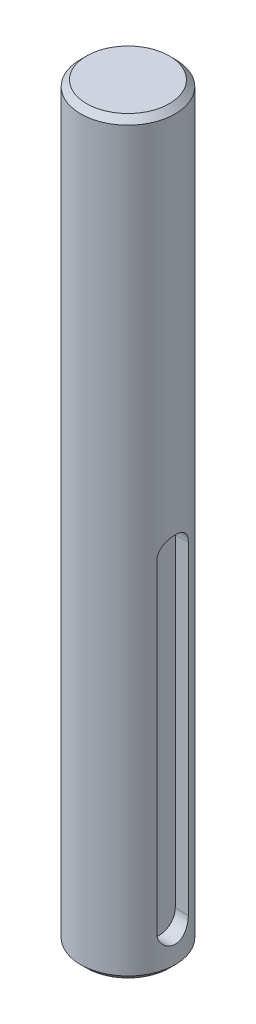
ISO-10303-21;
HEADER;
FILE_DESCRIPTION(('STEP AP214'),'2;1');
FILE_NAME('part.step','',(''),(''),'','','');
FILE_SCHEMA(('AUTOMOTIVE_DESIGN { 1 0 10303 214 1 1 1 1 }'));
ENDSEC;
DATA;
#1=APPLICATION_CONTEXT('core data for automotive mechanical design processes');
#2=APPLICATION_PROTOCOL_DEFINITION('international standard','automotive_design',2000,#1);
#3=PRODUCT_CONTEXT('',#1,'mechanical');
#4=PRODUCT('Part','Part','',(#3));
#5=PRODUCT_RELATED_PRODUCT_CATEGORY('part','',(#4));
#6=PRODUCT_DEFINITION_FORMATION('','',#4);
#7=PRODUCT_DEFINITION_CONTEXT('part definition',#1,'design');
#8=PRODUCT_DEFINITION('design','',#6,#7);
#9=PRODUCT_DEFINITION_SHAPE('','',#8);
#10=(LENGTH_UNIT() NAMED_UNIT(*) SI_UNIT(.MILLI.,.METRE.));
#11=(NAMED_UNIT(*) PLANE_ANGLE_UNIT() SI_UNIT($,.RADIAN.));
#12=(NAMED_UNIT(*) SI_UNIT($,.STERADIAN.) SOLID_ANGLE_UNIT());
#13=UNCERTAINTY_MEASURE_WITH_UNIT(LENGTH_MEASURE(1.E-05),#10,'distance_accuracy_value','');
#14=(GEOMETRIC_REPRESENTATION_CONTEXT(3) GLOBAL_UNCERTAINTY_ASSIGNED_CONTEXT((#13)) GLOBAL_UNIT_ASSIGNED_CONTEXT((#10,
#11,#12)) REPRESENTATION_CONTEXT('',''));
#15=CARTESIAN_POINT('',(0.,0.,0.));
#16=DIRECTION('',(0.,0.,1.));
#17=DIRECTION('',(1.,0.,0.));
#18=AXIS2_PLACEMENT_3D('',#15,#16,#17);
#19=CARTESIAN_POINT('',(0.,190.,0.));
#20=DIRECTION('',(0.,-1.,0.));
#21=DIRECTION('',(0.,0.,-1.));
#22=AXIS2_PLACEMENT_3D('',#19,#20,#21);
#23=CYLINDRICAL_SURFACE('',#22,12.);
#24=CARTESIAN_POINT('',(0.,1.49999999999997,0.));
#25=DIRECTION('',(0.,1.,0.));
#26=DIRECTION('',(0.,0.,1.));
#27=AXIS2_PLACEMENT_3D('',#24,#25,#26);
#28=CIRCLE('',#27,12.);
#29=CARTESIAN_POINT('',(0.,1.49999999999997,12.));
#30=VERTEX_POINT('',#29);
#31=EDGE_CURVE('E148',#30,#30,#28,.T.);
#32=ORIENTED_EDGE('',*,*,#31,.T.);
#33=EDGE_LOOP('',(#32));
#34=FACE_BOUND('',#33,.T.);
#35=CARTESIAN_POINT('',(0.,188.5,0.));
#36=DIRECTION('',(0.,1.,0.));
#37=DIRECTION('',(0.,0.,1.));
#38=AXIS2_PLACEMENT_3D('',#35,#36,#37);
#39=CIRCLE('',#38,12.);
#40=CARTESIAN_POINT('',(0.,188.5,12.));
#41=VERTEX_POINT('',#40);
#42=EDGE_CURVE('E152',#41,#41,#39,.F.);
#43=ORIENTED_EDGE('',*,*,#42,.T.);
#44=EDGE_LOOP('',(#43));
#45=FACE_BOUND('',#44,.T.);
#46=DIRECTION('',(0.,-1.,0.));
#47=VECTOR('',#46,1.);
#48=CARTESIAN_POINT('',(11.3137084989848,190.,-3.99999999999999));
#49=LINE('',#48,#47);
#50=CARTESIAN_POINT('',(11.3137084989848,92.,-4.));
#51=VERTEX_POINT('',#50);
#52=CARTESIAN_POINT('',(11.3137084989848,10.,-4.00000000000001));
#53=VERTEX_POINT('',#52);
#54=EDGE_CURVE('E55',#51,#53,#49,.T.);
#55=ORIENTED_EDGE('',*,*,#54,.T.);
#56=CARTESIAN_POINT('',(11.3137084989848,10.,-4.00000000000001));
#57=CARTESIAN_POINT('',(11.3136910923705,9.89086867548746,-4.00001438576651));
#58=CARTESIAN_POINT('',(11.3152871024731,9.78174708051936,-3.99553419554537));
#59=CARTESIAN_POINT('',(11.3215763859361,9.5643503386412,-3.97769673248753));
#60=CARTESIAN_POINT('',(11.3262688232103,9.45607497121915,-3.96434185595523));
#61=CARTESIAN_POINT('',(11.3386032840401,9.24145521863269,-3.92891935076475));
#62=CARTESIAN_POINT('',(11.3462365576019,9.1351060759185,-3.90687756421022));
#63=CARTESIAN_POINT('',(11.364201918496,8.92478677026761,-3.85430689648189));
#64=CARTESIAN_POINT('',(11.3745341033652,8.82081669345652,-3.82377770857635));
#65=CARTESIAN_POINT('',(11.4091190527027,8.5136614724559,-3.71986482089949));
#66=CARTESIAN_POINT('',(11.4369799021453,8.31491334804402,-3.63410266896588));
#67=CARTESIAN_POINT('',(11.4991525453998,7.93459710166259,-3.43228454569821));
#68=CARTESIAN_POINT('',(11.5334682968154,7.75303962276703,-3.31620997228938));
#69=CARTESIAN_POINT('',(11.6061789182336,7.40513135443086,-3.0522079335565));
#70=CARTESIAN_POINT('',(11.6446750308563,7.23954377151058,-2.90330055412142));
#71=CARTESIAN_POINT('',(11.7205540276094,6.9351726348864,-2.57995313902012));
#72=CARTESIAN_POINT('',(11.7579367125094,6.79639385411498,-2.40550856651357));
#73=CARTESIAN_POINT('',(11.8285552975691,6.5460828409488,-2.03041476001126));
#74=CARTESIAN_POINT('',(11.8616574966305,6.43535630673881,-1.82920040495824));
#75=CARTESIAN_POINT('',(11.9187843500282,6.24963074897781,-1.40971695235374));
#76=CARTESIAN_POINT('',(11.9428117769099,6.17462081138056,-1.19145308844237));
#77=CARTESIAN_POINT('',(11.9783628445804,6.06505715483855,-0.752117395358876));
#78=CARTESIAN_POINT('',(11.9902923605184,6.02918691490816,-0.531407346429917));
#79=CARTESIAN_POINT('',(12.0017443351774,5.99473480077591,-0.0867958692352903));
#80=CARTESIAN_POINT('',(12.0012697502156,5.99614404161265,0.137104785886805));
#81=CARTESIAN_POINT('',(11.9882415502496,6.03537709525262,0.572415361032308));
#82=CARTESIAN_POINT('',(11.9761624577266,6.07177040133038,0.783970739663748));
#83=CARTESIAN_POINT('',(11.9418784019559,6.1775729452123,1.19777632834893));
#84=CARTESIAN_POINT('',(11.9196728772387,6.24698401372685,1.40002602175549));
#85=CARTESIAN_POINT('',(11.8670267992102,6.41768490607038,1.79261022537108));
#86=CARTESIAN_POINT('',(11.8364817702071,6.51938203060614,1.98275302130577));
#87=CARTESIAN_POINT('',(11.7703352504572,6.7514419560314,2.34369935797277));
#88=CARTESIAN_POINT('',(11.7347323851811,6.88181255458766,2.51449761883743));
#89=CARTESIAN_POINT('',(11.6602518814889,7.17467579218445,2.84038544309997));
#90=CARTESIAN_POINT('',(11.6212989752184,7.33839011029893,2.99435951335508));
#91=CARTESIAN_POINT('',(11.5458957896576,7.68979803334581,3.27310303719342));
#92=CARTESIAN_POINT('',(11.5094463215614,7.87749935499965,3.39786305574724));
#93=CARTESIAN_POINT('',(11.4595759659792,8.17471295037722,3.56109757745214));
#94=CARTESIAN_POINT('',(11.4436484943195,8.27725540476748,3.61182358389814));
#95=CARTESIAN_POINT('',(11.4140167075143,8.48656498095631,3.70440095621127));
#96=CARTESIAN_POINT('',(11.4003114674865,8.5933303220756,3.74625601636387));
#97=CARTESIAN_POINT('',(11.3755873303494,8.81021708656647,3.82067426911564));
#98=CARTESIAN_POINT('',(11.3645655126344,8.92033471310406,3.85324757051516));
#99=CARTESIAN_POINT('',(11.3455648512893,9.14316815444737,3.90883841588791));
#100=CARTESIAN_POINT('',(11.3375846182867,9.25588275796183,3.93186032329111));
#101=CARTESIAN_POINT('',(11.3254693235584,9.47364244655076,3.96661962949783));
#102=CARTESIAN_POINT('',(11.3210705251979,9.57854951957861,3.97913375141091));
#103=CARTESIAN_POINT('',(11.3151843303776,9.78896833269984,3.99582494949882));
#104=CARTESIAN_POINT('',(11.3136931771535,9.89447911566788,4.00001278362332));
#105=CARTESIAN_POINT('',(11.3137084989848,10.,3.99999999999999));
#106=B_SPLINE_CURVE_WITH_KNOTS('',3,(#56,#57,#58,#59,#60,#61,#62,#63,#64,#65,#66,#67,#68,#69,
#70,#71,#72,#73,#74,#75,#76,#77,#78,#79,#80,#81,#82,#83,#84,#85,#86,#87,#88,#89,#90,#91,#92,#93,
#94,#95,#96,#97,#98,#99,#100,#101,#102,#103,#104,#105),.UNSPECIFIED.,.F.,.F.,(4,2,2,2,2,2,2,2,2,
2,2,2,2,2,2,2,2,2,2,2,2,2,2,2,4),(0.,0.327273938941731,0.654459544677847,0.980679087086519,
1.30691042048862,1.95841627077208,2.61032287944837,3.28524582541423,3.96028882145703,
4.65295094423118,5.34540127175222,6.01376445600325,6.68196834813282,7.32396236553654,
7.96599198323705,8.61646637994584,9.26711789045787,9.94834778922914,10.6297973968768,
10.9759539762202,11.3219661149517,11.6675999574416,12.0130757272824,12.3299368411189,
12.6463882889711),.UNSPECIFIED.);
#107=CARTESIAN_POINT('',(11.3137084989848,10.,3.99999999999999));
#108=VERTEX_POINT('',#107);
#109=EDGE_CURVE('E100',#53,#108,#106,.T.);
#110=ORIENTED_EDGE('',*,*,#109,.T.);
#111=DIRECTION('',(0.,-1.,0.));
#112=VECTOR('',#111,1.);
#113=CARTESIAN_POINT('',(11.3137084989848,190.,4.00000000000001));
#114=LINE('',#113,#112);
#115=CARTESIAN_POINT('',(11.3137084989848,92.,4.00000000000001));
#116=VERTEX_POINT('',#115);
#117=EDGE_CURVE('E153',#108,#116,#114,.F.);
#118=ORIENTED_EDGE('',*,*,#117,.T.);
#119=CARTESIAN_POINT('',(11.3137084989848,92.,4.));
#120=CARTESIAN_POINT('',(11.3136910923705,92.1091313245125,4.0000143857665));
#121=CARTESIAN_POINT('',(11.3152871024731,92.2182529194806,3.99553419554536));
#122=CARTESIAN_POINT('',(11.3215763859361,92.4356496613588,3.97769673248752));
#123=CARTESIAN_POINT('',(11.3262688232103,92.5439250287808,3.96434185595522));
#124=CARTESIAN_POINT('',(11.3386032840401,92.7585447813673,3.92891935076474));
#125=CARTESIAN_POINT('',(11.3462365576019,92.8648939240815,3.90687756421022));
#126=CARTESIAN_POINT('',(11.364201918496,93.0752132297324,3.85430689648189));
#127=CARTESIAN_POINT('',(11.3745341033652,93.1791833065435,3.82377770857635));
#128=CARTESIAN_POINT('',(11.4091190527027,93.4863385275441,3.71986482089948));
#129=CARTESIAN_POINT('',(11.4369799021453,93.685086651956,3.63410266896588));
#130=CARTESIAN_POINT('',(11.4991525453998,94.0654028983374,3.43228454569821));
#131=CARTESIAN_POINT('',(11.5334682968154,94.246960377233,3.31620997228937));
#132=CARTESIAN_POINT('',(11.6061789182336,94.5948686455691,3.05220793355649));
#133=CARTESIAN_POINT('',(11.6446750308563,94.7604562284894,2.9033005541214));
#134=CARTESIAN_POINT('',(11.7205540276094,95.0648273651136,2.5799531390201));
#135=CARTESIAN_POINT('',(11.7579367125094,95.203606145885,2.40550856651356));
#136=CARTESIAN_POINT('',(11.8285552975691,95.4539171590512,2.03041476001125));
#137=CARTESIAN_POINT('',(11.8616574966305,95.5646436932612,1.82920040495823));
#138=CARTESIAN_POINT('',(11.9187843500282,95.7503692510222,1.40971695235373));
#139=CARTESIAN_POINT('',(11.9428117769099,95.8253791886194,1.19145308844236));
#140=CARTESIAN_POINT('',(11.9783628445804,95.9349428451614,0.752117395358876));
#141=CARTESIAN_POINT('',(11.9902923605184,95.9708130850918,0.531407346429917));
#142=CARTESIAN_POINT('',(12.0017443351774,96.0052651992241,0.0867958692352895));
#143=CARTESIAN_POINT('',(12.0012697502156,96.0038559583873,-0.137104785886807));
#144=CARTESIAN_POINT('',(11.9882415502496,95.9646229047474,-0.572415361032309));
#145=CARTESIAN_POINT('',(11.9761624577266,95.9282295986696,-0.783970739663748));
#146=CARTESIAN_POINT('',(11.9418784019559,95.8224270547877,-1.19777632834893));
#147=CARTESIAN_POINT('',(11.9196728772387,95.7530159862731,-1.40002602175549));
#148=CARTESIAN_POINT('',(11.8670267992102,95.5823150939296,-1.79261022537108));
#149=CARTESIAN_POINT('',(11.8364817702071,95.4806179693939,-1.98275302130577));
#150=CARTESIAN_POINT('',(11.7703352504572,95.2485580439686,-2.34369935797278));
#151=CARTESIAN_POINT('',(11.7347323851811,95.1181874454123,-2.51449761883743));
#152=CARTESIAN_POINT('',(11.6602518814889,94.8253242078156,-2.84038544309997));
#153=CARTESIAN_POINT('',(11.6212989752184,94.6616098897011,-2.99435951335508));
#154=CARTESIAN_POINT('',(11.5458957896576,94.3102019666542,-3.27310303719342));
#155=CARTESIAN_POINT('',(11.5094463215614,94.1225006450004,-3.39786305574725));
#156=CARTESIAN_POINT('',(11.4595759659792,93.8252870496228,-3.56109757745214));
#157=CARTESIAN_POINT('',(11.4436484943195,93.7227445952325,-3.61182358389814));
#158=CARTESIAN_POINT('',(11.4140167075143,93.5134350190437,-3.70440095621127));
#159=CARTESIAN_POINT('',(11.4003114674865,93.4066696779244,-3.74625601636388));
#160=CARTESIAN_POINT('',(11.3755873303494,93.1897829134335,-3.82067426911564));
#161=CARTESIAN_POINT('',(11.3645655126344,93.079665286896,-3.85324757051516));
#162=CARTESIAN_POINT('',(11.3455648512893,92.8568318455526,-3.90883841588791));
#163=CARTESIAN_POINT('',(11.3375846182867,92.7441172420382,-3.93186032329111));
#164=CARTESIAN_POINT('',(11.3254693235584,92.5263575534492,-3.96661962949784));
#165=CARTESIAN_POINT('',(11.3210705251979,92.4214504804214,-3.97913375141091));
#166=CARTESIAN_POINT('',(11.3151843303776,92.2110316673002,-3.99582494949883));
#167=CARTESIAN_POINT('',(11.3136931771535,92.1055208843321,-4.00001278362333));
#168=CARTESIAN_POINT('',(11.3137084989848,92.,-4.));
#169=B_SPLINE_CURVE_WITH_KNOTS('',3,(#119,#120,#121,#122,#123,#124,#125,#126,#127,#128,#129,
#130,#131,#132,#133,#134,#135,#136,#137,#138,#139,#140,#141,#142,#143,#144,#145,#146,#147,#148,
#149,#150,#151,#152,#153,#154,#155,#156,#157,#158,#159,#160,#161,#162,#163,#164,#165,#166,#167,
#168),.UNSPECIFIED.,.F.,.F.,(4,2,2,2,2,2,2,2,2,2,2,2,2,2,2,2,2,2,2,2,2,2,2,2,4),(0.,
0.327273938941734,0.654459544677838,0.980679087086482,1.30691042048861,1.95841627077206,
2.61032287944838,3.28524582541424,3.96028882145703,4.65295094423118,5.34540127175221,
6.01376445600324,6.68196834813282,7.32396236553653,7.96599198323704,8.61646637994582,
9.26711789045787,9.94834778922912,10.6297973968768,10.9759539762202,11.3219661149517,
11.6675999574416,12.0130757272824,12.3299368411189,12.6463882889711),.UNSPECIFIED.);
#170=EDGE_CURVE('E47',#116,#51,#169,.T.);
#171=ORIENTED_EDGE('',*,*,#170,.T.);
#172=EDGE_LOOP('',(#55,#110,#118,#171));
#173=FACE_BOUND('',#172,.T.);
#174=ADVANCED_FACE('F32',(#34,#45,#173),#23,.T.);
#175=CARTESIAN_POINT('',(0.,190.,0.));
#176=DIRECTION('',(0.,1.,0.));
#177=DIRECTION('',(0.,0.,1.));
#178=AXIS2_PLACEMENT_3D('',#175,#176,#177);
#179=PLANE('',#178);
#180=CARTESIAN_POINT('',(0.,190.,0.));
#181=DIRECTION('',(0.,1.,0.));
#182=DIRECTION('',(0.,0.,1.));
#183=AXIS2_PLACEMENT_3D('',#180,#181,#182);
#184=CIRCLE('',#183,10.5);
#185=CARTESIAN_POINT('',(0.,190.,10.5));
#186=VERTEX_POINT('',#185);
#187=EDGE_CURVE('E11',#186,#186,#184,.T.);
#188=ORIENTED_EDGE('',*,*,#187,.T.);
#189=EDGE_LOOP('',(#188));
#190=FACE_BOUND('',#189,.T.);
#191=ADVANCED_FACE('F133',(#190),#179,.T.);
#192=CARTESIAN_POINT('',(0.,0.,0.));
#193=DIRECTION('',(0.,1.,0.));
#194=DIRECTION('',(0.,0.,1.));
#195=AXIS2_PLACEMENT_3D('',#192,#193,#194);
#196=PLANE('',#195);
#197=CARTESIAN_POINT('',(0.,0.,0.));
#198=DIRECTION('',(0.,1.,0.));
#199=DIRECTION('',(0.,0.,1.));
#200=AXIS2_PLACEMENT_3D('',#197,#198,#199);
#201=CIRCLE('',#200,10.5);
#202=CARTESIAN_POINT('',(0.,0.,10.5));
#203=VERTEX_POINT('',#202);
#204=EDGE_CURVE('E40',#203,#203,#201,.F.);
#205=ORIENTED_EDGE('',*,*,#204,.T.);
#206=EDGE_LOOP('',(#205));
#207=FACE_BOUND('',#206,.T.);
#208=ADVANCED_FACE('F132',(#207),#196,.F.);
#209=CARTESIAN_POINT('',(8.,92.,0.));
#210=DIRECTION('',(1.,0.,0.));
#211=DIRECTION('',(0.,0.,-1.));
#212=AXIS2_PLACEMENT_3D('',#209,#210,#211);
#213=CYLINDRICAL_SURFACE('',#212,4.);
#214=DIRECTION('',(1.,0.,0.));
#215=VECTOR('',#214,1.);
#216=CARTESIAN_POINT('',(8.,92.,4.));
#217=LINE('',#216,#215);
#218=CARTESIAN_POINT('',(8.,92.,4.));
#219=VERTEX_POINT('',#218);
#220=EDGE_CURVE('E72',#219,#116,#217,.T.);
#221=ORIENTED_EDGE('',*,*,#220,.F.);
#222=CARTESIAN_POINT('',(8.,92.,0.));
#223=DIRECTION('',(1.,0.,0.));
#224=DIRECTION('',(0.,0.,-1.));
#225=AXIS2_PLACEMENT_3D('',#222,#223,#224);
#226=CIRCLE('',#225,4.);
#227=CARTESIAN_POINT('',(8.,92.,-4.));
#228=VERTEX_POINT('',#227);
#229=EDGE_CURVE('E76',#228,#219,#226,.T.);
#230=ORIENTED_EDGE('',*,*,#229,.F.);
#231=DIRECTION('',(1.,0.,0.));
#232=VECTOR('',#231,1.);
#233=CARTESIAN_POINT('',(8.,92.,-4.));
#234=LINE('',#233,#232);
#235=EDGE_CURVE('E98',#228,#51,#234,.T.);
#236=ORIENTED_EDGE('',*,*,#235,.T.);
#237=ORIENTED_EDGE('',*,*,#170,.F.);
#238=EDGE_LOOP('',(#221,#230,#236,#237));
#239=FACE_BOUND('',#238,.T.);
#240=ADVANCED_FACE('F74',(#239),#213,.F.);
#241=CARTESIAN_POINT('',(8.,92.,-4.));
#242=DIRECTION('',(0.,0.,-1.));
#243=DIRECTION('',(0.,1.,0.));
#244=AXIS2_PLACEMENT_3D('',#241,#242,#243);
#245=PLANE('',#244);
#246=ORIENTED_EDGE('',*,*,#235,.F.);
#247=DIRECTION('',(0.,1.,0.));
#248=VECTOR('',#247,1.);
#249=CARTESIAN_POINT('',(8.,92.,-4.));
#250=LINE('',#249,#248);
#251=CARTESIAN_POINT('',(8.,10.,-4.00000000000001));
#252=VERTEX_POINT('',#251);
#253=EDGE_CURVE('E81',#252,#228,#250,.T.);
#254=ORIENTED_EDGE('',*,*,#253,.F.);
#255=DIRECTION('',(1.,0.,0.));
#256=VECTOR('',#255,1.);
#257=CARTESIAN_POINT('',(8.,10.,-4.00000000000001));
#258=LINE('',#257,#256);
#259=EDGE_CURVE('E101',#252,#53,#258,.T.);
#260=ORIENTED_EDGE('',*,*,#259,.T.);
#261=ORIENTED_EDGE('',*,*,#54,.F.);
#262=EDGE_LOOP('',(#246,#254,#260,#261));
#263=FACE_BOUND('',#262,.T.);
#264=ADVANCED_FACE('F125',(#263),#245,.F.);
#265=CARTESIAN_POINT('',(8.,10.,0.));
#266=DIRECTION('',(1.,0.,0.));
#267=DIRECTION('',(0.,0.,-1.));
#268=AXIS2_PLACEMENT_3D('',#265,#266,#267);
#269=CYLINDRICAL_SURFACE('',#268,4.);
#270=ORIENTED_EDGE('',*,*,#259,.F.);
#271=CARTESIAN_POINT('',(8.,10.,0.));
#272=DIRECTION('',(1.,0.,0.));
#273=DIRECTION('',(0.,0.,-1.));
#274=AXIS2_PLACEMENT_3D('',#271,#272,#273);
#275=CIRCLE('',#274,4.);
#276=CARTESIAN_POINT('',(8.,10.,3.99999999999999));
#277=VERTEX_POINT('',#276);
#278=EDGE_CURVE('E90',#277,#252,#275,.T.);
#279=ORIENTED_EDGE('',*,*,#278,.F.);
#280=DIRECTION('',(1.,0.,0.));
#281=VECTOR('',#280,1.);
#282=CARTESIAN_POINT('',(8.,10.,3.99999999999999));
#283=LINE('',#282,#281);
#284=EDGE_CURVE('E80',#277,#108,#283,.T.);
#285=ORIENTED_EDGE('',*,*,#284,.T.);
#286=ORIENTED_EDGE('',*,*,#109,.F.);
#287=EDGE_LOOP('',(#270,#279,#285,#286));
#288=FACE_BOUND('',#287,.T.);
#289=ADVANCED_FACE('F120',(#288),#269,.F.);
#290=CARTESIAN_POINT('',(8.,92.,4.));
#291=DIRECTION('',(0.,0.,1.));
#292=DIRECTION('',(0.,-1.,0.));
#293=AXIS2_PLACEMENT_3D('',#290,#291,#292);
#294=PLANE('',#293);
#295=ORIENTED_EDGE('',*,*,#284,.F.);
#296=DIRECTION('',(0.,-1.,0.));
#297=VECTOR('',#296,1.);
#298=CARTESIAN_POINT('',(8.,92.,4.));
#299=LINE('',#298,#297);
#300=EDGE_CURVE('E84',#219,#277,#299,.T.);
#301=ORIENTED_EDGE('',*,*,#300,.F.);
#302=ORIENTED_EDGE('',*,*,#220,.T.);
#303=ORIENTED_EDGE('',*,*,#117,.F.);
#304=EDGE_LOOP('',(#295,#301,#302,#303));
#305=FACE_BOUND('',#304,.T.);
#306=ADVANCED_FACE('F85',(#305),#294,.F.);
#307=CARTESIAN_POINT('',(8.,92.,0.));
#308=DIRECTION('',(1.,0.,0.));
#309=DIRECTION('',(0.,0.,-1.));
#310=AXIS2_PLACEMENT_3D('',#307,#308,#309);
#311=PLANE('',#310);
#312=ORIENTED_EDGE('',*,*,#229,.T.);
#313=ORIENTED_EDGE('',*,*,#300,.T.);
#314=ORIENTED_EDGE('',*,*,#278,.T.);
#315=ORIENTED_EDGE('',*,*,#253,.T.);
#316=EDGE_LOOP('',(#312,#313,#314,#315));
#317=FACE_BOUND('',#316,.T.);
#318=ADVANCED_FACE('F92',(#317),#311,.T.);
#319=CARTESIAN_POINT('',(0.,1.49999999999997,0.));
#320=DIRECTION('',(0.,1.,0.));
#321=DIRECTION('',(0.,0.,1.));
#322=AXIS2_PLACEMENT_3D('',#319,#320,#321);
#323=CONICAL_SURFACE('',#322,12.,0.785398163397445);
#324=ORIENTED_EDGE('',*,*,#204,.F.);
#325=EDGE_LOOP('',(#324));
#326=FACE_BOUND('',#325,.T.);
#327=ORIENTED_EDGE('',*,*,#31,.F.);
#328=EDGE_LOOP('',(#327));
#329=FACE_BOUND('',#328,.T.);
#330=ADVANCED_FACE('F159',(#326,#329),#323,.T.);
#331=CARTESIAN_POINT('',(0.,190.,0.));
#332=DIRECTION('',(0.,-1.,0.));
#333=DIRECTION('',(0.,0.,-1.));
#334=AXIS2_PLACEMENT_3D('',#331,#332,#333);
#335=CONICAL_SURFACE('',#334,10.5,0.785398163397455);
#336=ORIENTED_EDGE('',*,*,#42,.F.);
#337=EDGE_LOOP('',(#336));
#338=FACE_BOUND('',#337,.T.);
#339=ORIENTED_EDGE('',*,*,#187,.F.);
#340=EDGE_LOOP('',(#339));
#341=FACE_BOUND('',#340,.T.);
#342=ADVANCED_FACE('F34',(#338,#341),#335,.T.);
#343=CLOSED_SHELL('',(#174,#191,#208,#240,#264,#289,#306,#318,#330,#342));
#344=MANIFOLD_SOLID_BREP('B2',#343);
#345=ADVANCED_BREP_SHAPE_REPRESENTATION('',(#18,#344),#14);
#346=SHAPE_DEFINITION_REPRESENTATION(#9,#345);
ENDSEC;
END-ISO-10303-21;
